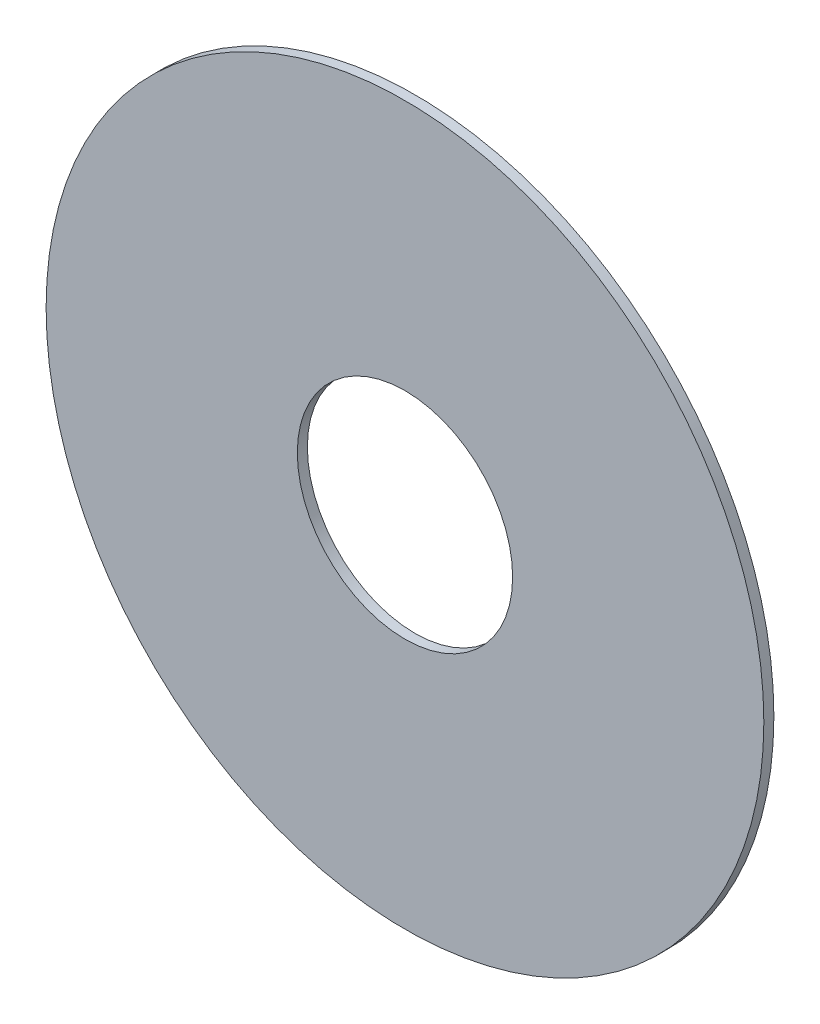
ISO-10303-21;
HEADER;
FILE_DESCRIPTION(('STEP AP214'),'2;1');
FILE_NAME('part.step','',(''),(''),'','','');
FILE_SCHEMA(('AUTOMOTIVE_DESIGN { 1 0 10303 214 1 1 1 1 }'));
ENDSEC;
DATA;
#1=APPLICATION_CONTEXT('core data for automotive mechanical design processes');
#2=APPLICATION_PROTOCOL_DEFINITION('international standard','automotive_design',2000,#1);
#3=PRODUCT_CONTEXT('',#1,'mechanical');
#4=PRODUCT('Part','Part','',(#3));
#5=PRODUCT_RELATED_PRODUCT_CATEGORY('part','',(#4));
#6=PRODUCT_DEFINITION_FORMATION('','',#4);
#7=PRODUCT_DEFINITION_CONTEXT('part definition',#1,'design');
#8=PRODUCT_DEFINITION('design','',#6,#7);
#9=PRODUCT_DEFINITION_SHAPE('','',#8);
#10=(LENGTH_UNIT() NAMED_UNIT(*) SI_UNIT(.MILLI.,.METRE.));
#11=(NAMED_UNIT(*) PLANE_ANGLE_UNIT() SI_UNIT($,.RADIAN.));
#12=(NAMED_UNIT(*) SI_UNIT($,.STERADIAN.) SOLID_ANGLE_UNIT());
#13=UNCERTAINTY_MEASURE_WITH_UNIT(LENGTH_MEASURE(1.E-05),#10,'distance_accuracy_value','');
#14=(GEOMETRIC_REPRESENTATION_CONTEXT(3) GLOBAL_UNCERTAINTY_ASSIGNED_CONTEXT((#13)) GLOBAL_UNIT_ASSIGNED_CONTEXT((#10,
#11,#12)) REPRESENTATION_CONTEXT('',''));
#15=CARTESIAN_POINT('',(0.,0.,0.));
#16=DIRECTION('',(0.,0.,1.));
#17=DIRECTION('',(1.,0.,0.));
#18=AXIS2_PLACEMENT_3D('',#15,#16,#17);
#19=CARTESIAN_POINT('',(173.228,-102.616,-0.045));
#20=DIRECTION('',(0.,0.,-1.));
#21=DIRECTION('',(0.,-1.,0.));
#22=AXIS2_PLACEMENT_3D('',#19,#20,#21);
#23=CYLINDRICAL_SURFACE('',#22,0.375);
#24=CARTESIAN_POINT('',(173.228,-102.616,-0.035));
#25=DIRECTION('',(0.,0.,-1.));
#26=DIRECTION('',(0.,-1.,0.));
#27=AXIS2_PLACEMENT_3D('',#24,#25,#26);
#28=CIRCLE('',#27,0.375);
#29=CARTESIAN_POINT('',(173.228,-102.991,-0.035));
#30=VERTEX_POINT('',#29);
#31=EDGE_CURVE('E25',#30,#30,#28,.T.);
#32=ORIENTED_EDGE('',*,*,#31,.T.);
#33=DIRECTION('',(0.,0.,1.));
#34=VECTOR('',#33,1.);
#35=CARTESIAN_POINT('',(173.228,-102.991,-0.045));
#36=LINE('',#35,#34);
#37=CARTESIAN_POINT('',(173.228,-102.991,0.));
#38=VERTEX_POINT('',#37);
#39=EDGE_CURVE('E11',#30,#38,#36,.T.);
#40=ORIENTED_EDGE('',*,*,#39,.T.);
#41=CARTESIAN_POINT('',(173.228,-102.616,0.));
#42=DIRECTION('',(0.,0.,-1.));
#43=DIRECTION('',(0.,-1.,0.));
#44=AXIS2_PLACEMENT_3D('',#41,#42,#43);
#45=CIRCLE('',#44,0.375);
#46=EDGE_CURVE('E68',#38,#38,#45,.T.);
#47=ORIENTED_EDGE('',*,*,#46,.F.);
#48=ORIENTED_EDGE('',*,*,#39,.F.);
#49=EDGE_LOOP('',(#32,#40,#47,#48));
#50=FACE_BOUND('',#49,.T.);
#51=ADVANCED_FACE('F17',(#50),#23,.F.);
#52=CARTESIAN_POINT('',(173.228,-102.616,-0.035));
#53=DIRECTION('',(0.,0.,1.));
#54=DIRECTION('',(1.,0.,0.));
#55=AXIS2_PLACEMENT_3D('',#52,#53,#54);
#56=PLANE('',#55);
#57=ORIENTED_EDGE('',*,*,#31,.F.);
#58=EDGE_LOOP('',(#57));
#59=FACE_BOUND('',#58,.T.);
#60=CARTESIAN_POINT('',(173.228,-102.616,-0.035));
#61=DIRECTION('',(0.,0.,1.));
#62=DIRECTION('',(1.,0.,0.));
#63=AXIS2_PLACEMENT_3D('',#60,#61,#62);
#64=CIRCLE('',#63,1.25);
#65=CARTESIAN_POINT('',(174.478,-102.616,-0.035));
#66=VERTEX_POINT('',#65);
#67=EDGE_CURVE('E56',#66,#66,#64,.T.);
#68=ORIENTED_EDGE('',*,*,#67,.F.);
#69=EDGE_LOOP('',(#68));
#70=FACE_BOUND('',#69,.T.);
#71=ADVANCED_FACE('F77',(#59,#70),#56,.F.);
#72=CARTESIAN_POINT('',(173.228,-102.616,0.));
#73=DIRECTION('',(0.,0.,1.));
#74=DIRECTION('',(1.,0.,0.));
#75=AXIS2_PLACEMENT_3D('',#72,#73,#74);
#76=PLANE('',#75);
#77=ORIENTED_EDGE('',*,*,#46,.T.);
#78=EDGE_LOOP('',(#77));
#79=FACE_BOUND('',#78,.T.);
#80=CARTESIAN_POINT('',(173.228,-102.616,0.));
#81=DIRECTION('',(0.,0.,1.));
#82=DIRECTION('',(1.,0.,0.));
#83=AXIS2_PLACEMENT_3D('',#80,#81,#82);
#84=CIRCLE('',#83,1.25);
#85=CARTESIAN_POINT('',(174.478,-102.616,0.));
#86=VERTEX_POINT('',#85);
#87=EDGE_CURVE('E54',#86,#86,#84,.T.);
#88=ORIENTED_EDGE('',*,*,#87,.T.);
#89=EDGE_LOOP('',(#88));
#90=FACE_BOUND('',#89,.T.);
#91=ADVANCED_FACE('F60',(#79,#90),#76,.T.);
#92=CARTESIAN_POINT('',(173.228,-102.616,-0.035));
#93=DIRECTION('',(0.,0.,1.));
#94=DIRECTION('',(1.,0.,0.));
#95=AXIS2_PLACEMENT_3D('',#92,#93,#94);
#96=CYLINDRICAL_SURFACE('',#95,1.25);
#97=ORIENTED_EDGE('',*,*,#87,.F.);
#98=DIRECTION('',(0.,0.,1.));
#99=VECTOR('',#98,1.);
#100=CARTESIAN_POINT('',(174.478,-102.616,-0.035));
#101=LINE('',#100,#99);
#102=EDGE_CURVE('E51',#66,#86,#101,.T.);
#103=ORIENTED_EDGE('',*,*,#102,.F.);
#104=ORIENTED_EDGE('',*,*,#67,.T.);
#105=ORIENTED_EDGE('',*,*,#102,.T.);
#106=EDGE_LOOP('',(#97,#103,#104,#105));
#107=FACE_BOUND('',#106,.T.);
#108=ADVANCED_FACE('F53',(#107),#96,.T.);
#109=CLOSED_SHELL('',(#51,#71,#91,#108));
#110=MANIFOLD_SOLID_BREP('B1',#109);
#111=ADVANCED_BREP_SHAPE_REPRESENTATION('',(#18,#110),#14);
#112=SHAPE_DEFINITION_REPRESENTATION(#9,#111);
ENDSEC;
END-ISO-10303-21;
